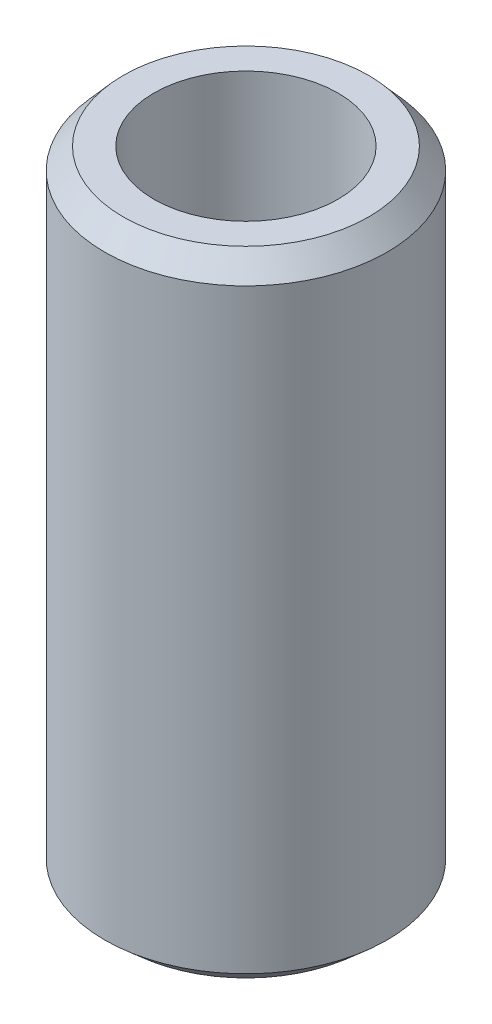
ISO-10303-21;
HEADER;
FILE_DESCRIPTION(('STEP AP214'),'2;1');
FILE_NAME('part.step','',(''),(''),'','','');
FILE_SCHEMA(('AUTOMOTIVE_DESIGN { 1 0 10303 214 1 1 1 1 }'));
ENDSEC;
DATA;
#1=APPLICATION_CONTEXT('core data for automotive mechanical design processes');
#2=APPLICATION_PROTOCOL_DEFINITION('international standard','automotive_design',2000,#1);
#3=PRODUCT_CONTEXT('',#1,'mechanical');
#4=PRODUCT('Part','Part','',(#3));
#5=PRODUCT_RELATED_PRODUCT_CATEGORY('part','',(#4));
#6=PRODUCT_DEFINITION_FORMATION('','',#4);
#7=PRODUCT_DEFINITION_CONTEXT('part definition',#1,'design');
#8=PRODUCT_DEFINITION('design','',#6,#7);
#9=PRODUCT_DEFINITION_SHAPE('','',#8);
#10=(LENGTH_UNIT() NAMED_UNIT(*) SI_UNIT(.MILLI.,.METRE.));
#11=(NAMED_UNIT(*) PLANE_ANGLE_UNIT() SI_UNIT($,.RADIAN.));
#12=(NAMED_UNIT(*) SI_UNIT($,.STERADIAN.) SOLID_ANGLE_UNIT());
#13=UNCERTAINTY_MEASURE_WITH_UNIT(LENGTH_MEASURE(1.E-05),#10,'distance_accuracy_value','');
#14=(GEOMETRIC_REPRESENTATION_CONTEXT(3) GLOBAL_UNCERTAINTY_ASSIGNED_CONTEXT((#13)) GLOBAL_UNIT_ASSIGNED_CONTEXT((#10,
#11,#12)) REPRESENTATION_CONTEXT('',''));
#15=CARTESIAN_POINT('',(0.,0.,0.));
#16=DIRECTION('',(0.,0.,1.));
#17=DIRECTION('',(1.,0.,0.));
#18=AXIS2_PLACEMENT_3D('',#15,#16,#17);
#19=CARTESIAN_POINT('',(0.,179.93640928662,0.));
#20=DIRECTION('',(0.,-1.,0.));
#21=DIRECTION('',(0.,0.,-1.));
#22=AXIS2_PLACEMENT_3D('',#19,#20,#21);
#23=CYLINDRICAL_SURFACE('',#22,40.);
#24=CARTESIAN_POINT('',(0.,173.944606107102,0.));
#25=DIRECTION('',(0.,1.,0.));
#26=DIRECTION('',(0.,0.,1.));
#27=AXIS2_PLACEMENT_3D('',#24,#25,#26);
#28=CIRCLE('',#27,40.);
#29=CARTESIAN_POINT('',(0.,173.944606107102,40.));
#30=VERTEX_POINT('',#29);
#31=EDGE_CURVE('E50',#30,#30,#28,.F.);
#32=ORIENTED_EDGE('',*,*,#31,.T.);
#33=EDGE_LOOP('',(#32));
#34=FACE_BOUND('',#33,.T.);
#35=CARTESIAN_POINT('',(0.,5.26646317740184,0.));
#36=DIRECTION('',(0.,1.,0.));
#37=DIRECTION('',(0.,0.,1.));
#38=AXIS2_PLACEMENT_3D('',#35,#36,#37);
#39=CIRCLE('',#38,40.);
#40=CARTESIAN_POINT('',(0.,5.26646317740184,40.));
#41=VERTEX_POINT('',#40);
#42=EDGE_CURVE('E51',#41,#41,#39,.T.);
#43=ORIENTED_EDGE('',*,*,#42,.T.);
#44=EDGE_LOOP('',(#43));
#45=FACE_BOUND('',#44,.T.);
#46=ADVANCED_FACE('F39',(#34,#45),#23,.T.);
#47=CARTESIAN_POINT('',(0.,179.93640928662,0.));
#48=DIRECTION('',(0.,1.,0.));
#49=DIRECTION('',(0.,0.,1.));
#50=AXIS2_PLACEMENT_3D('',#47,#48,#49);
#51=PLANE('',#50);
#52=CARTESIAN_POINT('',(0.,179.93640928662,0.));
#53=DIRECTION('',(0.,1.,0.));
#54=DIRECTION('',(0.,0.,1.));
#55=AXIS2_PLACEMENT_3D('',#52,#53,#54);
#56=CIRCLE('',#55,34.7335368225981);
#57=CARTESIAN_POINT('',(0.,179.93640928662,34.7335368225981));
#58=VERTEX_POINT('',#57);
#59=EDGE_CURVE('E54',#58,#58,#56,.T.);
#60=ORIENTED_EDGE('',*,*,#59,.T.);
#61=EDGE_LOOP('',(#60));
#62=FACE_BOUND('',#61,.T.);
#63=CARTESIAN_POINT('',(0.,179.93640928662,0.));
#64=DIRECTION('',(0.,1.,0.));
#65=DIRECTION('',(0.,0.,1.));
#66=AXIS2_PLACEMENT_3D('',#63,#64,#65);
#67=CIRCLE('',#66,26.0681675998851);
#68=CARTESIAN_POINT('',(0.,179.93640928662,26.0681675998851));
#69=VERTEX_POINT('',#68);
#70=EDGE_CURVE('E58',#69,#69,#67,.T.);
#71=ORIENTED_EDGE('',*,*,#70,.F.);
#72=EDGE_LOOP('',(#71));
#73=FACE_BOUND('',#72,.T.);
#74=ADVANCED_FACE('F69',(#62,#73),#51,.T.);
#75=CARTESIAN_POINT('',(0.,0.,0.));
#76=DIRECTION('',(0.,1.,0.));
#77=DIRECTION('',(0.,0.,1.));
#78=AXIS2_PLACEMENT_3D('',#75,#76,#77);
#79=PLANE('',#78);
#80=CARTESIAN_POINT('',(0.,0.,0.));
#81=DIRECTION('',(0.,1.,0.));
#82=DIRECTION('',(0.,0.,1.));
#83=AXIS2_PLACEMENT_3D('',#80,#81,#82);
#84=CIRCLE('',#83,34.0081968204819);
#85=CARTESIAN_POINT('',(0.,0.,34.0081968204819));
#86=VERTEX_POINT('',#85);
#87=EDGE_CURVE('E10',#86,#86,#84,.F.);
#88=ORIENTED_EDGE('',*,*,#87,.T.);
#89=EDGE_LOOP('',(#88));
#90=FACE_BOUND('',#89,.T.);
#91=CARTESIAN_POINT('',(0.,0.,0.));
#92=DIRECTION('',(0.,1.,0.));
#93=DIRECTION('',(0.,0.,1.));
#94=AXIS2_PLACEMENT_3D('',#91,#92,#93);
#95=CIRCLE('',#94,26.0681675998851);
#96=CARTESIAN_POINT('',(0.,0.,26.0681675998851));
#97=VERTEX_POINT('',#96);
#98=EDGE_CURVE('E63',#97,#97,#95,.T.);
#99=ORIENTED_EDGE('',*,*,#98,.T.);
#100=EDGE_LOOP('',(#99));
#101=FACE_BOUND('',#100,.T.);
#102=ADVANCED_FACE('F75',(#90,#101),#79,.F.);
#103=CARTESIAN_POINT('',(0.,179.93640928662,0.));
#104=DIRECTION('',(0.,-1.,0.));
#105=DIRECTION('',(0.,0.,-1.));
#106=AXIS2_PLACEMENT_3D('',#103,#104,#105);
#107=CYLINDRICAL_SURFACE('',#106,26.0681675998851);
#108=ORIENTED_EDGE('',*,*,#70,.T.);
#109=EDGE_LOOP('',(#108));
#110=FACE_BOUND('',#109,.T.);
#111=ORIENTED_EDGE('',*,*,#98,.F.);
#112=EDGE_LOOP('',(#111));
#113=FACE_BOUND('',#112,.T.);
#114=ADVANCED_FACE('F70',(#110,#113),#107,.F.);
#115=CARTESIAN_POINT('',(0.,179.93640928662,0.));
#116=DIRECTION('',(0.,-1.,0.));
#117=DIRECTION('',(0.,0.,-1.));
#118=AXIS2_PLACEMENT_3D('',#115,#116,#117);
#119=CONICAL_SURFACE('',#118,34.7335368225981,0.721059758940295);
#120=ORIENTED_EDGE('',*,*,#31,.F.);
#121=EDGE_LOOP('',(#120));
#122=FACE_BOUND('',#121,.T.);
#123=ORIENTED_EDGE('',*,*,#59,.F.);
#124=EDGE_LOOP('',(#123));
#125=FACE_BOUND('',#124,.T.);
#126=ADVANCED_FACE('F81',(#122,#125),#119,.T.);
#127=CARTESIAN_POINT('',(0.,5.26646317740184,0.));
#128=DIRECTION('',(0.,1.,0.));
#129=DIRECTION('',(0.,0.,1.));
#130=AXIS2_PLACEMENT_3D('',#127,#128,#129);
#131=CONICAL_SURFACE('',#130,40.,0.849736567854603);
#132=ORIENTED_EDGE('',*,*,#87,.F.);
#133=EDGE_LOOP('',(#132));
#134=FACE_BOUND('',#133,.T.);
#135=ORIENTED_EDGE('',*,*,#42,.F.);
#136=EDGE_LOOP('',(#135));
#137=FACE_BOUND('',#136,.T.);
#138=ADVANCED_FACE('F45',(#134,#137),#131,.T.);
#139=CLOSED_SHELL('',(#46,#74,#102,#114,#126,#138));
#140=MANIFOLD_SOLID_BREP('B2',#139);
#141=ADVANCED_BREP_SHAPE_REPRESENTATION('',(#18,#140),#14);
#142=SHAPE_DEFINITION_REPRESENTATION(#9,#141);
ENDSEC;
END-ISO-10303-21;
